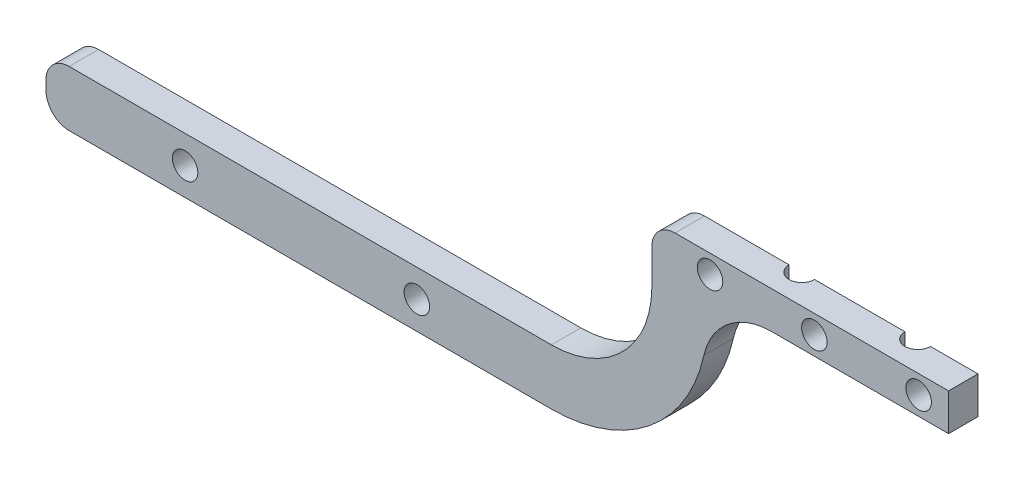
ISO-10303-21;
HEADER;
FILE_DESCRIPTION(('STEP AP214'),'2;1');
FILE_NAME('part.step','',(''),(''),'','','');
FILE_SCHEMA(('AUTOMOTIVE_DESIGN { 1 0 10303 214 1 1 1 1 }'));
ENDSEC;
DATA;
#1=APPLICATION_CONTEXT('core data for automotive mechanical design processes');
#2=APPLICATION_PROTOCOL_DEFINITION('international standard','automotive_design',2000,#1);
#3=PRODUCT_CONTEXT('',#1,'mechanical');
#4=PRODUCT('Part','Part','',(#3));
#5=PRODUCT_RELATED_PRODUCT_CATEGORY('part','',(#4));
#6=PRODUCT_DEFINITION_FORMATION('','',#4);
#7=PRODUCT_DEFINITION_CONTEXT('part definition',#1,'design');
#8=PRODUCT_DEFINITION('design','',#6,#7);
#9=PRODUCT_DEFINITION_SHAPE('','',#8);
#10=(LENGTH_UNIT() NAMED_UNIT(*) SI_UNIT(.MILLI.,.METRE.));
#11=(NAMED_UNIT(*) PLANE_ANGLE_UNIT() SI_UNIT($,.RADIAN.));
#12=(NAMED_UNIT(*) SI_UNIT($,.STERADIAN.) SOLID_ANGLE_UNIT());
#13=UNCERTAINTY_MEASURE_WITH_UNIT(LENGTH_MEASURE(1.E-05),#10,'distance_accuracy_value','');
#14=(GEOMETRIC_REPRESENTATION_CONTEXT(3) GLOBAL_UNCERTAINTY_ASSIGNED_CONTEXT((#13)) GLOBAL_UNIT_ASSIGNED_CONTEXT((#10,
#11,#12)) REPRESENTATION_CONTEXT('',''));
#15=CARTESIAN_POINT('',(0.,0.,0.));
#16=DIRECTION('',(0.,0.,1.));
#17=DIRECTION('',(1.,0.,0.));
#18=AXIS2_PLACEMENT_3D('',#15,#16,#17);
#19=CARTESIAN_POINT('',(-85.6878302558046,-12.5521697441954,0.));
#20=DIRECTION('',(0.,0.,1.));
#21=DIRECTION('',(1.,0.,0.));
#22=AXIS2_PLACEMENT_3D('',#19,#20,#21);
#23=PLANE('',#22);
#24=CARTESIAN_POINT('',(-6.45253062163277,-4.,0.));
#25=DIRECTION('',(0.,0.,1.));
#26=DIRECTION('',(1.,0.,0.));
#27=AXIS2_PLACEMENT_3D('',#24,#25,#26);
#28=CIRCLE('',#27,2.75);
#29=CARTESIAN_POINT('',(-3.70253062163277,-4.,0.));
#30=VERTEX_POINT('',#29);
#31=EDGE_CURVE('E340',#30,#30,#28,.T.);
#32=ORIENTED_EDGE('',*,*,#31,.T.);
#33=EDGE_LOOP('',(#32));
#34=FACE_BOUND('',#33,.T.);
#35=DIRECTION('',(1.,0.,0.));
#36=VECTOR('',#35,1.);
#37=CARTESIAN_POINT('',(0.,-8.,0.));
#38=LINE('',#37,#36);
#39=CARTESIAN_POINT('',(-10.25,-8.,0.));
#40=VERTEX_POINT('',#39);
#41=CARTESIAN_POINT('',(0.,-8.,0.));
#42=VERTEX_POINT('',#41);
#43=EDGE_CURVE('E172',#40,#42,#38,.T.);
#44=ORIENTED_EDGE('',*,*,#43,.F.);
#45=DIRECTION('',(0.,1.,0.));
#46=VECTOR('',#45,1.);
#47=CARTESIAN_POINT('',(-10.25,-46.241,0.));
#48=LINE('',#47,#46);
#49=CARTESIAN_POINT('',(-10.25,0.,0.));
#50=VERTEX_POINT('',#49);
#51=EDGE_CURVE('E160',#50,#40,#48,.F.);
#52=ORIENTED_EDGE('',*,*,#51,.F.);
#53=DIRECTION('',(-1.,0.,0.));
#54=VECTOR('',#53,1.);
#55=CARTESIAN_POINT('',(0.,0.,0.));
#56=LINE('',#55,#54);
#57=CARTESIAN_POINT('',(0.,0.,0.));
#58=VERTEX_POINT('',#57);
#59=EDGE_CURVE('E170',#58,#50,#56,.T.);
#60=ORIENTED_EDGE('',*,*,#59,.F.);
#61=DIRECTION('',(0.,1.,0.));
#62=VECTOR('',#61,1.);
#63=CARTESIAN_POINT('',(0.,0.,0.));
#64=LINE('',#63,#62);
#65=EDGE_CURVE('E185',#42,#58,#64,.T.);
#66=ORIENTED_EDGE('',*,*,#65,.F.);
#67=EDGE_LOOP('',(#44,#52,#60,#66));
#68=FACE_BOUND('',#67,.T.);
#69=ADVANCED_FACE('F39',(#34,#68),#23,.F.);
#70=CARTESIAN_POINT('',(-28.9525306216328,-4.00000000000001,0.));
#71=DIRECTION('',(0.,0.,1.));
#72=DIRECTION('',(1.,0.,0.));
#73=AXIS2_PLACEMENT_3D('',#70,#71,#72);
#74=CIRCLE('',#73,2.75);
#75=CARTESIAN_POINT('',(-26.2025306216328,-4.00000000000001,0.));
#76=VERTEX_POINT('',#75);
#77=EDGE_CURVE('E342',#76,#76,#74,.T.);
#78=ORIENTED_EDGE('',*,*,#77,.T.);
#79=EDGE_LOOP('',(#78));
#80=FACE_BOUND('',#79,.T.);
#81=CARTESIAN_POINT('',(-15.75,0.,0.));
#82=VERTEX_POINT('',#81);
#83=CARTESIAN_POINT('',(-35.25,0.,0.));
#84=VERTEX_POINT('',#83);
#85=EDGE_CURVE('E179',#82,#84,#56,.T.);
#86=ORIENTED_EDGE('',*,*,#85,.F.);
#87=DIRECTION('',(0.,1.,0.));
#88=VECTOR('',#87,1.);
#89=CARTESIAN_POINT('',(-15.75,-46.241,0.));
#90=LINE('',#89,#88);
#91=CARTESIAN_POINT('',(-15.75,-8.,0.));
#92=VERTEX_POINT('',#91);
#93=EDGE_CURVE('E161',#92,#82,#90,.T.);
#94=ORIENTED_EDGE('',*,*,#93,.F.);
#95=CARTESIAN_POINT('',(-35.25,-8.00000000000001,0.));
#96=VERTEX_POINT('',#95);
#97=EDGE_CURVE('E218',#96,#92,#38,.T.);
#98=ORIENTED_EDGE('',*,*,#97,.F.);
#99=DIRECTION('',(0.,1.,0.));
#100=VECTOR('',#99,1.);
#101=CARTESIAN_POINT('',(-35.25,-46.241,0.));
#102=LINE('',#101,#100);
#103=EDGE_CURVE('E237',#84,#96,#102,.F.);
#104=ORIENTED_EDGE('',*,*,#103,.F.);
#105=EDGE_LOOP('',(#86,#94,#98,#104));
#106=FACE_BOUND('',#105,.T.);
#107=ADVANCED_FACE('F285',(#80,#106),#23,.F.);
#108=CARTESIAN_POINT('',(0.,0.,6.35));
#109=DIRECTION('',(-1.,0.,0.));
#110=DIRECTION('',(0.,-1.,0.));
#111=AXIS2_PLACEMENT_3D('',#108,#109,#110);
#112=PLANE('',#111);
#113=ORIENTED_EDGE('',*,*,#65,.T.);
#114=DIRECTION('',(0.,0.,-1.));
#115=VECTOR('',#114,1.);
#116=CARTESIAN_POINT('',(0.,0.,6.35));
#117=LINE('',#116,#115);
#118=CARTESIAN_POINT('',(0.,0.,6.35));
#119=VERTEX_POINT('',#118);
#120=EDGE_CURVE('E176',#119,#58,#117,.T.);
#121=ORIENTED_EDGE('',*,*,#120,.F.);
#122=DIRECTION('',(0.,1.,0.));
#123=VECTOR('',#122,1.);
#124=CARTESIAN_POINT('',(0.,0.,6.35));
#125=LINE('',#124,#123);
#126=CARTESIAN_POINT('',(0.,-8.,6.35));
#127=VERTEX_POINT('',#126);
#128=EDGE_CURVE('E215',#127,#119,#125,.T.);
#129=ORIENTED_EDGE('',*,*,#128,.F.);
#130=DIRECTION('',(0.,0.,-1.));
#131=VECTOR('',#130,1.);
#132=CARTESIAN_POINT('',(0.,-8.,6.35));
#133=LINE('',#132,#131);
#134=EDGE_CURVE('E196',#127,#42,#133,.T.);
#135=ORIENTED_EDGE('',*,*,#134,.T.);
#136=EDGE_LOOP('',(#113,#121,#129,#135));
#137=FACE_BOUND('',#136,.T.);
#138=ADVANCED_FACE('F315',(#137),#112,.F.);
#139=CARTESIAN_POINT('',(0.,0.,6.35));
#140=DIRECTION('',(0.,-1.,0.));
#141=DIRECTION('',(1.,0.,0.));
#142=AXIS2_PLACEMENT_3D('',#139,#140,#141);
#143=PLANE('',#142);
#144=ORIENTED_EDGE('',*,*,#59,.T.);
#145=CARTESIAN_POINT('',(-13.,0.,0.));
#146=DIRECTION('',(0.,1.,0.));
#147=DIRECTION('',(-1.,0.,0.));
#148=AXIS2_PLACEMENT_3D('',#145,#146,#147);
#149=CIRCLE('',#148,2.75);
#150=EDGE_CURVE('E157',#82,#50,#149,.T.);
#151=ORIENTED_EDGE('',*,*,#150,.F.);
#152=ORIENTED_EDGE('',*,*,#85,.T.);
#153=CARTESIAN_POINT('',(-38.,0.,0.));
#154=DIRECTION('',(0.,1.,0.));
#155=DIRECTION('',(-1.,0.,0.));
#156=AXIS2_PLACEMENT_3D('',#153,#154,#155);
#157=CIRCLE('',#156,2.75);
#158=CARTESIAN_POINT('',(-40.75,0.,0.));
#159=VERTEX_POINT('',#158);
#160=EDGE_CURVE('E239',#159,#84,#157,.T.);
#161=ORIENTED_EDGE('',*,*,#160,.F.);
#162=CARTESIAN_POINT('',(-59.,0.,0.));
#163=VERTEX_POINT('',#162);
#164=EDGE_CURVE('E181',#159,#163,#56,.T.);
#165=ORIENTED_EDGE('',*,*,#164,.T.);
#166=DIRECTION('',(0.,0.,-1.));
#167=VECTOR('',#166,1.);
#168=CARTESIAN_POINT('',(-59.,0.,6.35));
#169=LINE('',#168,#167);
#170=CARTESIAN_POINT('',(-59.,0.,6.35));
#171=VERTEX_POINT('',#170);
#172=EDGE_CURVE('E363',#163,#171,#169,.F.);
#173=ORIENTED_EDGE('',*,*,#172,.T.);
#174=DIRECTION('',(-1.,0.,0.));
#175=VECTOR('',#174,1.);
#176=CARTESIAN_POINT('',(0.,0.,6.35));
#177=LINE('',#176,#175);
#178=EDGE_CURVE('E212',#119,#171,#177,.T.);
#179=ORIENTED_EDGE('',*,*,#178,.F.);
#180=ORIENTED_EDGE('',*,*,#120,.T.);
#181=EDGE_LOOP('',(#144,#151,#152,#161,#165,#173,#179,#180));
#182=FACE_BOUND('',#181,.T.);
#183=ADVANCED_FACE('F174',(#182),#143,.F.);
#184=CARTESIAN_POINT('',(-64.,0.,6.35));
#185=DIRECTION('',(1.,0.,0.));
#186=DIRECTION('',(0.,0.,-1.));
#187=AXIS2_PLACEMENT_3D('',#184,#185,#186);
#188=PLANE('',#187);
#189=DIRECTION('',(0.,-1.,0.));
#190=VECTOR('',#189,1.);
#191=CARTESIAN_POINT('',(-64.,0.,6.35));
#192=LINE('',#191,#190);
#193=CARTESIAN_POINT('',(-64.,-5.00000000000001,6.35));
#194=VERTEX_POINT('',#193);
#195=CARTESIAN_POINT('',(-64.,-12.5521697441954,6.35));
#196=VERTEX_POINT('',#195);
#197=EDGE_CURVE('E210',#194,#196,#192,.T.);
#198=ORIENTED_EDGE('',*,*,#197,.F.);
#199=DIRECTION('',(0.,0.,-1.));
#200=VECTOR('',#199,1.);
#201=CARTESIAN_POINT('',(-64.,-5.00000000000001,6.35));
#202=LINE('',#201,#200);
#203=CARTESIAN_POINT('',(-64.,-5.00000000000001,0.));
#204=VERTEX_POINT('',#203);
#205=EDGE_CURVE('E412',#194,#204,#202,.T.);
#206=ORIENTED_EDGE('',*,*,#205,.T.);
#207=DIRECTION('',(0.,-1.,0.));
#208=VECTOR('',#207,1.);
#209=CARTESIAN_POINT('',(-64.,0.,0.));
#210=LINE('',#209,#208);
#211=CARTESIAN_POINT('',(-64.,-12.5521697441954,0.));
#212=VERTEX_POINT('',#211);
#213=EDGE_CURVE('E178',#204,#212,#210,.T.);
#214=ORIENTED_EDGE('',*,*,#213,.T.);
#215=DIRECTION('',(0.,0.,-1.));
#216=VECTOR('',#215,1.);
#217=CARTESIAN_POINT('',(-64.,-12.5521697441954,6.35));
#218=LINE('',#217,#216);
#219=EDGE_CURVE('E414',#196,#212,#218,.T.);
#220=ORIENTED_EDGE('',*,*,#219,.F.);
#221=EDGE_LOOP('',(#198,#206,#214,#220));
#222=FACE_BOUND('',#221,.T.);
#223=ADVANCED_FACE('F308',(#222),#188,.F.);
#224=CARTESIAN_POINT('',(-85.6878302558046,-12.5521697441954,6.35));
#225=DIRECTION('',(0.,0.,-1.));
#226=DIRECTION('',(-1.,0.,0.));
#227=AXIS2_PLACEMENT_3D('',#224,#225,#226);
#228=CYLINDRICAL_SURFACE('',#227,21.6878302558046);
#229=CARTESIAN_POINT('',(-85.6878302558046,-12.5521697441954,0.));
#230=DIRECTION('',(0.,0.,-1.));
#231=DIRECTION('',(-1.,0.,0.));
#232=AXIS2_PLACEMENT_3D('',#229,#230,#231);
#233=CIRCLE('',#232,21.6878302558046);
#234=CARTESIAN_POINT('',(-85.6878302558046,-34.24,0.));
#235=VERTEX_POINT('',#234);
#236=EDGE_CURVE('E182',#212,#235,#233,.T.);
#237=ORIENTED_EDGE('',*,*,#236,.T.);
#238=DIRECTION('',(0.,0.,-1.));
#239=VECTOR('',#238,1.);
#240=CARTESIAN_POINT('',(-85.6878302558046,-34.24,6.35));
#241=LINE('',#240,#239);
#242=CARTESIAN_POINT('',(-85.6878302558046,-34.24,6.35));
#243=VERTEX_POINT('',#242);
#244=EDGE_CURVE('E432',#243,#235,#241,.T.);
#245=ORIENTED_EDGE('',*,*,#244,.F.);
#246=CARTESIAN_POINT('',(-85.6878302558046,-12.5521697441954,6.35));
#247=DIRECTION('',(0.,0.,-1.));
#248=DIRECTION('',(-1.,0.,0.));
#249=AXIS2_PLACEMENT_3D('',#246,#247,#248);
#250=CIRCLE('',#249,21.6878302558046);
#251=EDGE_CURVE('E208',#196,#243,#250,.T.);
#252=ORIENTED_EDGE('',*,*,#251,.F.);
#253=ORIENTED_EDGE('',*,*,#219,.T.);
#254=EDGE_LOOP('',(#237,#245,#252,#253));
#255=FACE_BOUND('',#254,.T.);
#256=ADVANCED_FACE('F304',(#255),#228,.F.);
#257=CARTESIAN_POINT('',(-85.6878302558046,-34.24,6.35));
#258=DIRECTION('',(0.,-1.,0.));
#259=DIRECTION('',(1.,0.,0.));
#260=AXIS2_PLACEMENT_3D('',#257,#258,#259);
#261=PLANE('',#260);
#262=DIRECTION('',(-1.,0.,0.));
#263=VECTOR('',#262,1.);
#264=CARTESIAN_POINT('',(-85.6878302558046,-34.24,0.));
#265=LINE('',#264,#263);
#266=CARTESIAN_POINT('',(-189.687830255805,-34.24,0.));
#267=VERTEX_POINT('',#266);
#268=EDGE_CURVE('E428',#235,#267,#265,.T.);
#269=ORIENTED_EDGE('',*,*,#268,.T.);
#270=DIRECTION('',(0.,0.,-1.));
#271=VECTOR('',#270,1.);
#272=CARTESIAN_POINT('',(-189.687830255805,-34.24,6.35));
#273=LINE('',#272,#271);
#274=CARTESIAN_POINT('',(-189.687830255805,-34.24,6.35));
#275=VERTEX_POINT('',#274);
#276=EDGE_CURVE('E384',#267,#275,#273,.F.);
#277=ORIENTED_EDGE('',*,*,#276,.T.);
#278=DIRECTION('',(-1.,0.,0.));
#279=VECTOR('',#278,1.);
#280=CARTESIAN_POINT('',(-85.6878302558046,-34.24,6.35));
#281=LINE('',#280,#279);
#282=EDGE_CURVE('E205',#243,#275,#281,.T.);
#283=ORIENTED_EDGE('',*,*,#282,.F.);
#284=ORIENTED_EDGE('',*,*,#244,.T.);
#285=EDGE_LOOP('',(#269,#277,#283,#284));
#286=FACE_BOUND('',#285,.T.);
#287=ADVANCED_FACE('F300',(#286),#261,.F.);
#288=CARTESIAN_POINT('',(-194.687830255805,-34.24,6.35));
#289=DIRECTION('',(1.,0.,0.));
#290=DIRECTION('',(0.,0.,-1.));
#291=AXIS2_PLACEMENT_3D('',#288,#289,#290);
#292=PLANE('',#291);
#293=DIRECTION('',(0.,-1.,0.));
#294=VECTOR('',#293,1.);
#295=CARTESIAN_POINT('',(-194.687830255805,-34.24,0.));
#296=LINE('',#295,#294);
#297=CARTESIAN_POINT('',(-194.687830255805,-39.24,0.));
#298=VERTEX_POINT('',#297);
#299=CARTESIAN_POINT('',(-194.687830255805,-41.24,0.));
#300=VERTEX_POINT('',#299);
#301=EDGE_CURVE('E423',#298,#300,#296,.T.);
#302=ORIENTED_EDGE('',*,*,#301,.T.);
#303=DIRECTION('',(0.,0.,-1.));
#304=VECTOR('',#303,1.);
#305=CARTESIAN_POINT('',(-194.687830255805,-41.24,6.35));
#306=LINE('',#305,#304);
#307=CARTESIAN_POINT('',(-194.687830255805,-41.24,6.35));
#308=VERTEX_POINT('',#307);
#309=EDGE_CURVE('E382',#300,#308,#306,.F.);
#310=ORIENTED_EDGE('',*,*,#309,.T.);
#311=DIRECTION('',(0.,-1.,0.));
#312=VECTOR('',#311,1.);
#313=CARTESIAN_POINT('',(-194.687830255805,-34.24,6.35));
#314=LINE('',#313,#312);
#315=CARTESIAN_POINT('',(-194.687830255805,-39.24,6.35));
#316=VERTEX_POINT('',#315);
#317=EDGE_CURVE('E202',#316,#308,#314,.T.);
#318=ORIENTED_EDGE('',*,*,#317,.F.);
#319=DIRECTION('',(0.,0.,-1.));
#320=VECTOR('',#319,1.);
#321=CARTESIAN_POINT('',(-194.687830255805,-39.24,6.35));
#322=LINE('',#321,#320);
#323=EDGE_CURVE('E379',#316,#298,#322,.T.);
#324=ORIENTED_EDGE('',*,*,#323,.T.);
#325=EDGE_LOOP('',(#302,#310,#318,#324));
#326=FACE_BOUND('',#325,.T.);
#327=ADVANCED_FACE('F296',(#326),#292,.F.);
#328=CARTESIAN_POINT('',(-194.687830255805,-46.24,6.35));
#329=DIRECTION('',(0.,1.,0.));
#330=DIRECTION('',(-1.,0.,0.));
#331=AXIS2_PLACEMENT_3D('',#328,#329,#330);
#332=PLANE('',#331);
#333=DIRECTION('',(1.,0.,0.));
#334=VECTOR('',#333,1.);
#335=CARTESIAN_POINT('',(-194.687830255805,-46.24,6.35));
#336=LINE('',#335,#334);
#337=CARTESIAN_POINT('',(-189.687830255805,-46.24,6.35));
#338=VERTEX_POINT('',#337);
#339=CARTESIAN_POINT('',(-85.6878302558046,-46.24,6.35));
#340=VERTEX_POINT('',#339);
#341=EDGE_CURVE('E200',#338,#340,#336,.T.);
#342=ORIENTED_EDGE('',*,*,#341,.F.);
#343=DIRECTION('',(0.,0.,-1.));
#344=VECTOR('',#343,1.);
#345=CARTESIAN_POINT('',(-189.687830255805,-46.24,6.35));
#346=LINE('',#345,#344);
#347=CARTESIAN_POINT('',(-189.687830255805,-46.24,0.));
#348=VERTEX_POINT('',#347);
#349=EDGE_CURVE('E376',#338,#348,#346,.T.);
#350=ORIENTED_EDGE('',*,*,#349,.T.);
#351=DIRECTION('',(1.,0.,0.));
#352=VECTOR('',#351,1.);
#353=CARTESIAN_POINT('',(-194.687830255805,-46.24,0.));
#354=LINE('',#353,#352);
#355=CARTESIAN_POINT('',(-85.6878302558046,-46.24,0.));
#356=VERTEX_POINT('',#355);
#357=EDGE_CURVE('E400',#348,#356,#354,.T.);
#358=ORIENTED_EDGE('',*,*,#357,.T.);
#359=DIRECTION('',(0.,0.,-1.));
#360=VECTOR('',#359,1.);
#361=CARTESIAN_POINT('',(-85.6878302558046,-46.24,6.35));
#362=LINE('',#361,#360);
#363=EDGE_CURVE('E399',#340,#356,#362,.T.);
#364=ORIENTED_EDGE('',*,*,#363,.F.);
#365=EDGE_LOOP('',(#342,#350,#358,#364));
#366=FACE_BOUND('',#365,.T.);
#367=ADVANCED_FACE('F292',(#366),#332,.F.);
#368=CARTESIAN_POINT('',(-85.6878302558046,-12.5521697441954,6.35));
#369=DIRECTION('',(0.,0.,-1.));
#370=DIRECTION('',(-1.,0.,0.));
#371=AXIS2_PLACEMENT_3D('',#368,#369,#370);
#372=CYLINDRICAL_SURFACE('',#371,33.6878302558046);
#373=CARTESIAN_POINT('',(-85.6878302558046,-12.5521697441954,0.));
#374=DIRECTION('',(0.,0.,1.));
#375=DIRECTION('',(1.,0.,0.));
#376=AXIS2_PLACEMENT_3D('',#373,#374,#375);
#377=CIRCLE('',#376,33.6878302558046);
#378=CARTESIAN_POINT('',(-52.7847704375923,-19.7811781093206,0.));
#379=VERTEX_POINT('',#378);
#380=EDGE_CURVE('E394',#356,#379,#377,.T.);
#381=ORIENTED_EDGE('',*,*,#380,.T.);
#382=DIRECTION('',(0.,0.,-1.));
#383=VECTOR('',#382,1.);
#384=CARTESIAN_POINT('',(-52.7847704375923,-19.7811781093206,6.35));
#385=LINE('',#384,#383);
#386=CARTESIAN_POINT('',(-52.7847704375923,-19.7811781093206,6.35));
#387=VERTEX_POINT('',#386);
#388=EDGE_CURVE('E389',#379,#387,#385,.F.);
#389=ORIENTED_EDGE('',*,*,#388,.T.);
#390=CARTESIAN_POINT('',(-85.6878302558046,-12.5521697441954,6.35));
#391=DIRECTION('',(0.,0.,1.));
#392=DIRECTION('',(1.,0.,0.));
#393=AXIS2_PLACEMENT_3D('',#390,#391,#392);
#394=CIRCLE('',#393,33.6878302558046);
#395=EDGE_CURVE('E197',#340,#387,#394,.T.);
#396=ORIENTED_EDGE('',*,*,#395,.F.);
#397=ORIENTED_EDGE('',*,*,#363,.T.);
#398=EDGE_LOOP('',(#381,#389,#396,#397));
#399=FACE_BOUND('',#398,.T.);
#400=ADVANCED_FACE('F288',(#399),#372,.T.);
#401=CARTESIAN_POINT('',(0.,-8.,6.35));
#402=DIRECTION('',(0.,1.,0.));
#403=DIRECTION('',(-1.,0.,0.));
#404=AXIS2_PLACEMENT_3D('',#401,#402,#403);
#405=PLANE('',#404);
#406=ORIENTED_EDGE('',*,*,#97,.T.);
#407=CARTESIAN_POINT('',(-13.,-8.,0.));
#408=DIRECTION('',(0.,1.,0.));
#409=DIRECTION('',(-1.,0.,0.));
#410=AXIS2_PLACEMENT_3D('',#407,#408,#409);
#411=CIRCLE('',#410,2.75);
#412=EDGE_CURVE('E56',#40,#92,#411,.F.);
#413=ORIENTED_EDGE('',*,*,#412,.F.);
#414=ORIENTED_EDGE('',*,*,#43,.T.);
#415=ORIENTED_EDGE('',*,*,#134,.F.);
#416=DIRECTION('',(1.,0.,0.));
#417=VECTOR('',#416,1.);
#418=CARTESIAN_POINT('',(0.,-8.,6.35));
#419=LINE('',#418,#417);
#420=CARTESIAN_POINT('',(-38.134200973026,-8.00000000000001,6.35));
#421=VERTEX_POINT('',#420);
#422=EDGE_CURVE('E194',#421,#127,#419,.T.);
#423=ORIENTED_EDGE('',*,*,#422,.F.);
#424=DIRECTION('',(0.,0.,1.));
#425=VECTOR('',#424,1.);
#426=CARTESIAN_POINT('',(-38.134200973026,-8.00000000000001,0.));
#427=LINE('',#426,#425);
#428=CARTESIAN_POINT('',(-38.134200973026,-8.00000000000001,2.74672352064034));
#429=VERTEX_POINT('',#428);
#430=EDGE_CURVE('E386',#421,#429,#427,.F.);
#431=ORIENTED_EDGE('',*,*,#430,.T.);
#432=CARTESIAN_POINT('',(-38.,-8.00000000000001,0.));
#433=DIRECTION('',(0.,1.,0.));
#434=DIRECTION('',(-1.,0.,0.));
#435=AXIS2_PLACEMENT_3D('',#432,#433,#434);
#436=CIRCLE('',#435,2.75);
#437=EDGE_CURVE('E64',#96,#429,#436,.F.);
#438=ORIENTED_EDGE('',*,*,#437,.F.);
#439=EDGE_LOOP('',(#406,#413,#414,#415,#423,#431,#438));
#440=FACE_BOUND('',#439,.T.);
#441=ADVANCED_FACE('F279',(#440),#405,.F.);
#442=CARTESIAN_POINT('',(-85.6878302558046,-12.5521697441954,6.35));
#443=DIRECTION('',(0.,0.,1.));
#444=DIRECTION('',(1.,0.,0.));
#445=AXIS2_PLACEMENT_3D('',#442,#443,#444);
#446=PLANE('',#445);
#447=CARTESIAN_POINT('',(-164.687830255805,-40.24,6.35));
#448=DIRECTION('',(0.,0.,1.));
#449=DIRECTION('',(1.,0.,0.));
#450=AXIS2_PLACEMENT_3D('',#447,#448,#449);
#451=CIRCLE('',#450,2.75000000000001);
#452=CARTESIAN_POINT('',(-161.937830255805,-40.24,6.35));
#453=VERTEX_POINT('',#452);
#454=EDGE_CURVE('E226',#453,#453,#451,.T.);
#455=ORIENTED_EDGE('',*,*,#454,.F.);
#456=EDGE_LOOP('',(#455));
#457=FACE_BOUND('',#456,.T.);
#458=CARTESIAN_POINT('',(-51.4525306216328,-4.00000000000001,6.35));
#459=DIRECTION('',(0.,0.,1.));
#460=DIRECTION('',(1.,0.,0.));
#461=AXIS2_PLACEMENT_3D('',#458,#459,#460);
#462=CIRCLE('',#461,2.75);
#463=CARTESIAN_POINT('',(-48.7025306216328,-4.00000000000001,6.35));
#464=VERTEX_POINT('',#463);
#465=EDGE_CURVE('E227',#464,#464,#462,.T.);
#466=ORIENTED_EDGE('',*,*,#465,.F.);
#467=EDGE_LOOP('',(#466));
#468=FACE_BOUND('',#467,.T.);
#469=CARTESIAN_POINT('',(-28.9525306216328,-4.00000000000001,6.35));
#470=DIRECTION('',(0.,0.,1.));
#471=DIRECTION('',(1.,0.,0.));
#472=AXIS2_PLACEMENT_3D('',#469,#470,#471);
#473=CIRCLE('',#472,2.75);
#474=CARTESIAN_POINT('',(-26.2025306216328,-4.00000000000001,6.35));
#475=VERTEX_POINT('',#474);
#476=EDGE_CURVE('E223',#475,#475,#473,.T.);
#477=ORIENTED_EDGE('',*,*,#476,.F.);
#478=EDGE_LOOP('',(#477));
#479=FACE_BOUND('',#478,.T.);
#480=CARTESIAN_POINT('',(-6.45253062163277,-4.,6.35));
#481=DIRECTION('',(0.,0.,1.));
#482=DIRECTION('',(1.,0.,0.));
#483=AXIS2_PLACEMENT_3D('',#480,#481,#482);
#484=CIRCLE('',#483,2.75);
#485=CARTESIAN_POINT('',(-3.70253062163277,-4.,6.35));
#486=VERTEX_POINT('',#485);
#487=EDGE_CURVE('E219',#486,#486,#484,.T.);
#488=ORIENTED_EDGE('',*,*,#487,.F.);
#489=EDGE_LOOP('',(#488));
#490=FACE_BOUND('',#489,.T.);
#491=CARTESIAN_POINT('',(-114.687830255805,-40.24,6.35));
#492=DIRECTION('',(0.,0.,1.));
#493=DIRECTION('',(1.,0.,0.));
#494=AXIS2_PLACEMENT_3D('',#491,#492,#493);
#495=CIRCLE('',#494,2.75000000000001);
#496=CARTESIAN_POINT('',(-111.937830255805,-40.24,6.35));
#497=VERTEX_POINT('',#496);
#498=EDGE_CURVE('E222',#497,#497,#495,.T.);
#499=ORIENTED_EDGE('',*,*,#498,.F.);
#500=EDGE_LOOP('',(#499));
#501=FACE_BOUND('',#500,.T.);
#502=ORIENTED_EDGE('',*,*,#178,.T.);
#503=CARTESIAN_POINT('',(-59.,-5.00000000000001,6.35));
#504=DIRECTION('',(0.,0.,1.));
#505=DIRECTION('',(1.,0.,0.));
#506=AXIS2_PLACEMENT_3D('',#503,#504,#505);
#507=CIRCLE('',#506,5.);
#508=EDGE_CURVE('E367',#171,#194,#507,.T.);
#509=ORIENTED_EDGE('',*,*,#508,.T.);
#510=ORIENTED_EDGE('',*,*,#197,.T.);
#511=ORIENTED_EDGE('',*,*,#251,.T.);
#512=ORIENTED_EDGE('',*,*,#282,.T.);
#513=CARTESIAN_POINT('',(-189.687830255805,-39.24,6.35));
#514=DIRECTION('',(0.,0.,1.));
#515=DIRECTION('',(1.,0.,0.));
#516=AXIS2_PLACEMENT_3D('',#513,#514,#515);
#517=CIRCLE('',#516,5.);
#518=EDGE_CURVE('E368',#275,#316,#517,.T.);
#519=ORIENTED_EDGE('',*,*,#518,.T.);
#520=ORIENTED_EDGE('',*,*,#317,.T.);
#521=CARTESIAN_POINT('',(-189.687830255805,-41.24,6.35));
#522=DIRECTION('',(0.,0.,1.));
#523=DIRECTION('',(1.,0.,0.));
#524=AXIS2_PLACEMENT_3D('',#521,#522,#523);
#525=CIRCLE('',#524,5.);
#526=EDGE_CURVE('E370',#308,#338,#525,.T.);
#527=ORIENTED_EDGE('',*,*,#526,.T.);
#528=ORIENTED_EDGE('',*,*,#341,.T.);
#529=ORIENTED_EDGE('',*,*,#395,.T.);
#530=CARTESIAN_POINT('',(-38.134200973026,-23.,6.35));
#531=DIRECTION('',(0.,0.,1.));
#532=DIRECTION('',(1.,0.,0.));
#533=AXIS2_PLACEMENT_3D('',#530,#531,#532);
#534=CIRCLE('',#533,15.);
#535=EDGE_CURVE('E11',#387,#421,#534,.F.);
#536=ORIENTED_EDGE('',*,*,#535,.T.);
#537=ORIENTED_EDGE('',*,*,#422,.T.);
#538=ORIENTED_EDGE('',*,*,#128,.T.);
#539=EDGE_LOOP('',(#502,#509,#510,#511,#512,#519,#520,#527,#528,#529,#536,#537,#538));
#540=FACE_BOUND('',#539,.T.);
#541=ADVANCED_FACE('F275',(#457,#468,#479,#490,#501,#540),#446,.T.);
#542=CARTESIAN_POINT('',(-164.687830255805,-40.24,0.));
#543=DIRECTION('',(0.,0.,1.));
#544=DIRECTION('',(1.,0.,0.));
#545=AXIS2_PLACEMENT_3D('',#542,#543,#544);
#546=CIRCLE('',#545,2.75000000000001);
#547=CARTESIAN_POINT('',(-161.937830255805,-40.24,0.));
#548=VERTEX_POINT('',#547);
#549=EDGE_CURVE('E43',#548,#548,#546,.T.);
#550=ORIENTED_EDGE('',*,*,#549,.T.);
#551=EDGE_LOOP('',(#550));
#552=FACE_BOUND('',#551,.T.);
#553=CARTESIAN_POINT('',(-51.4525306216328,-4.00000000000001,0.));
#554=DIRECTION('',(0.,0.,1.));
#555=DIRECTION('',(1.,0.,0.));
#556=AXIS2_PLACEMENT_3D('',#553,#554,#555);
#557=CIRCLE('',#556,2.75);
#558=CARTESIAN_POINT('',(-48.7025306216328,-4.00000000000001,0.));
#559=VERTEX_POINT('',#558);
#560=EDGE_CURVE('E192',#559,#559,#557,.T.);
#561=ORIENTED_EDGE('',*,*,#560,.T.);
#562=EDGE_LOOP('',(#561));
#563=FACE_BOUND('',#562,.T.);
#564=CARTESIAN_POINT('',(-114.687830255805,-40.24,0.));
#565=DIRECTION('',(0.,0.,1.));
#566=DIRECTION('',(1.,0.,0.));
#567=AXIS2_PLACEMENT_3D('',#564,#565,#566);
#568=CIRCLE('',#567,2.75000000000001);
#569=CARTESIAN_POINT('',(-111.937830255805,-40.24,0.));
#570=VERTEX_POINT('',#569);
#571=EDGE_CURVE('E234',#570,#570,#568,.T.);
#572=ORIENTED_EDGE('',*,*,#571,.T.);
#573=EDGE_LOOP('',(#572));
#574=FACE_BOUND('',#573,.T.);
#575=ORIENTED_EDGE('',*,*,#164,.F.);
#576=DIRECTION('',(0.,1.,0.));
#577=VECTOR('',#576,1.);
#578=CARTESIAN_POINT('',(-40.75,-46.241,0.));
#579=LINE('',#578,#577);
#580=CARTESIAN_POINT('',(-40.75,-8.22984104857088,0.));
#581=VERTEX_POINT('',#580);
#582=EDGE_CURVE('E235',#581,#159,#579,.T.);
#583=ORIENTED_EDGE('',*,*,#582,.F.);
#584=CARTESIAN_POINT('',(-38.134200973026,-23.,0.));
#585=DIRECTION('',(0.,0.,1.));
#586=DIRECTION('',(1.,0.,0.));
#587=AXIS2_PLACEMENT_3D('',#584,#585,#586);
#588=CIRCLE('',#587,15.);
#589=EDGE_CURVE('E48',#581,#379,#588,.T.);
#590=ORIENTED_EDGE('',*,*,#589,.T.);
#591=ORIENTED_EDGE('',*,*,#380,.F.);
#592=ORIENTED_EDGE('',*,*,#357,.F.);
#593=CARTESIAN_POINT('',(-189.687830255805,-41.24,0.));
#594=DIRECTION('',(0.,0.,1.));
#595=DIRECTION('',(1.,0.,0.));
#596=AXIS2_PLACEMENT_3D('',#593,#594,#595);
#597=CIRCLE('',#596,5.);
#598=EDGE_CURVE('E364',#348,#300,#597,.F.);
#599=ORIENTED_EDGE('',*,*,#598,.T.);
#600=ORIENTED_EDGE('',*,*,#301,.F.);
#601=CARTESIAN_POINT('',(-189.687830255805,-39.24,0.));
#602=DIRECTION('',(0.,0.,1.));
#603=DIRECTION('',(1.,0.,0.));
#604=AXIS2_PLACEMENT_3D('',#601,#602,#603);
#605=CIRCLE('',#604,5.);
#606=EDGE_CURVE('E416',#298,#267,#605,.F.);
#607=ORIENTED_EDGE('',*,*,#606,.T.);
#608=ORIENTED_EDGE('',*,*,#268,.F.);
#609=ORIENTED_EDGE('',*,*,#236,.F.);
#610=ORIENTED_EDGE('',*,*,#213,.F.);
#611=CARTESIAN_POINT('',(-59.,-5.00000000000001,0.));
#612=DIRECTION('',(0.,0.,1.));
#613=DIRECTION('',(1.,0.,0.));
#614=AXIS2_PLACEMENT_3D('',#611,#612,#613);
#615=CIRCLE('',#614,5.);
#616=EDGE_CURVE('E358',#204,#163,#615,.F.);
#617=ORIENTED_EDGE('',*,*,#616,.T.);
#618=EDGE_LOOP('',(#575,#583,#590,#591,#592,#599,#600,#607,#608,#609,#610,#617));
#619=FACE_BOUND('',#618,.T.);
#620=ADVANCED_FACE('F278',(#552,#563,#574,#619),#23,.F.);
#621=CARTESIAN_POINT('',(-59.,-5.00000000000001,6.35));
#622=DIRECTION('',(0.,0.,-1.));
#623=DIRECTION('',(-1.,0.,0.));
#624=AXIS2_PLACEMENT_3D('',#621,#622,#623);
#625=CYLINDRICAL_SURFACE('',#624,5.);
#626=ORIENTED_EDGE('',*,*,#508,.F.);
#627=ORIENTED_EDGE('',*,*,#172,.F.);
#628=ORIENTED_EDGE('',*,*,#616,.F.);
#629=ORIENTED_EDGE('',*,*,#205,.F.);
#630=EDGE_LOOP('',(#626,#627,#628,#629));
#631=FACE_BOUND('',#630,.T.);
#632=ADVANCED_FACE('F283',(#631),#625,.T.);
#633=CARTESIAN_POINT('',(-189.687830255805,-41.24,6.35));
#634=DIRECTION('',(0.,0.,-1.));
#635=DIRECTION('',(-1.,0.,0.));
#636=AXIS2_PLACEMENT_3D('',#633,#634,#635);
#637=CYLINDRICAL_SURFACE('',#636,5.);
#638=ORIENTED_EDGE('',*,*,#526,.F.);
#639=ORIENTED_EDGE('',*,*,#309,.F.);
#640=ORIENTED_EDGE('',*,*,#598,.F.);
#641=ORIENTED_EDGE('',*,*,#349,.F.);
#642=EDGE_LOOP('',(#638,#639,#640,#641));
#643=FACE_BOUND('',#642,.T.);
#644=ADVANCED_FACE('F320',(#643),#637,.T.);
#645=CARTESIAN_POINT('',(-189.687830255805,-39.24,6.35));
#646=DIRECTION('',(0.,0.,-1.));
#647=DIRECTION('',(-1.,0.,0.));
#648=AXIS2_PLACEMENT_3D('',#645,#646,#647);
#649=CYLINDRICAL_SURFACE('',#648,5.);
#650=ORIENTED_EDGE('',*,*,#518,.F.);
#651=ORIENTED_EDGE('',*,*,#276,.F.);
#652=ORIENTED_EDGE('',*,*,#606,.F.);
#653=ORIENTED_EDGE('',*,*,#323,.F.);
#654=EDGE_LOOP('',(#650,#651,#652,#653));
#655=FACE_BOUND('',#654,.T.);
#656=ADVANCED_FACE('F323',(#655),#649,.T.);
#657=CARTESIAN_POINT('',(-38.134200973026,-23.,6.35));
#658=DIRECTION('',(0.,0.,-1.));
#659=DIRECTION('',(-1.,0.,0.));
#660=AXIS2_PLACEMENT_3D('',#657,#658,#659);
#661=CYLINDRICAL_SURFACE('',#660,15.);
#662=ORIENTED_EDGE('',*,*,#589,.F.);
#663=CARTESIAN_POINT('',(-38.134200973026,-8.00000000000001,2.74672352064034));
#664=CARTESIAN_POINT('',(-38.2108335559254,-7.99999444331259,2.74298748938228));
#665=CARTESIAN_POINT('',(-38.2873040931662,-8.00058713922194,2.73602854997542));
#666=CARTESIAN_POINT('',(-38.4393720275473,-8.0029133184828,2.71575481129172));
#667=CARTESIAN_POINT('',(-38.5149695215431,-8.00464667402802,2.70244072412929));
#668=CARTESIAN_POINT('',(-38.6646566243315,-8.00919534524404,2.6695684127049));
#669=CARTESIAN_POINT('',(-38.7387481657535,-8.01200916809179,2.65001880999992));
#670=CARTESIAN_POINT('',(-38.8849851223723,-8.0186218536759,2.60483515648356));
#671=CARTESIAN_POINT('',(-38.9571305335688,-8.0224207184368,2.57920109316684));
#672=CARTESIAN_POINT('',(-39.1699152613968,-8.03512779475429,2.49341828228826));
#673=CARTESIAN_POINT('',(-39.3070095747824,-8.04534998194946,2.42436539265486));
#674=CARTESIAN_POINT('',(-39.5676241592745,-8.06807182862282,2.26460900459081));
#675=CARTESIAN_POINT('',(-39.691143900354,-8.0805715769791,2.173904661205));
#676=CARTESIAN_POINT('',(-39.9225514196479,-8.10652830087425,1.97232352030094));
#677=CARTESIAN_POINT('',(-40.0302723745869,-8.11999352631784,1.86125594539744));
#678=CARTESIAN_POINT('',(-40.2256610016869,-8.1461941865441,1.62256826071098));
#679=CARTESIAN_POINT('',(-40.3133230940184,-8.15892941752557,1.49494356061955));
#680=CARTESIAN_POINT('',(-40.4665507525349,-8.1822334213953,1.22586642054482));
#681=CARTESIAN_POINT('',(-40.531981925693,-8.19278887150694,1.084336322036));
#682=CARTESIAN_POINT('',(-40.6380154630544,-8.21034707088235,0.792130331173696));
#683=CARTESIAN_POINT('',(-40.6786435089966,-8.21735349360745,0.641464076974112));
#684=CARTESIAN_POINT('',(-40.7208169017524,-8.22469575939914,0.407909646227999));
#685=CARTESIAN_POINT('',(-40.7317586108755,-8.2266192412328,0.326661441658059));
#686=CARTESIAN_POINT('',(-40.7463452933083,-8.22919341842279,0.163621785509527));
#687=CARTESIAN_POINT('',(-40.7500017265516,-8.22984611272485,0.0818313905099495));
#688=CARTESIAN_POINT('',(-40.75,-8.22984104857088,0.));
#689=B_SPLINE_CURVE_WITH_KNOTS('',3,(#663,#664,#665,#666,#667,#668,#669,#670,#671,#672,#673,
#674,#675,#676,#677,#678,#679,#680,#681,#682,#683,#684,#685,#686,#687,#688),.UNSPECIFIED.,.F.,
.F.,(4,2,2,2,2,2,2,2,2,2,2,2,4),(0.,0.230093045131893,0.460160313660527,0.689910847877426,
0.919661854302873,1.3788406102955,1.8380372888221,2.30177901549816,2.76564958609599,
3.23227648266377,3.69841939971023,3.94413539668606,4.1894645697224),.UNSPECIFIED.);
#690=EDGE_CURVE('E241',#429,#581,#689,.T.);
#691=ORIENTED_EDGE('',*,*,#690,.F.);
#692=ORIENTED_EDGE('',*,*,#430,.F.);
#693=ORIENTED_EDGE('',*,*,#535,.F.);
#694=ORIENTED_EDGE('',*,*,#388,.F.);
#695=EDGE_LOOP('',(#662,#691,#692,#693,#694));
#696=FACE_BOUND('',#695,.T.);
#697=ADVANCED_FACE('F41',(#696),#661,.F.);
#698=CARTESIAN_POINT('',(-114.687830255805,-40.24,-3.65));
#699=DIRECTION('',(0.,0.,1.));
#700=DIRECTION('',(1.,0.,0.));
#701=AXIS2_PLACEMENT_3D('',#698,#699,#700);
#702=CYLINDRICAL_SURFACE('',#701,2.75000000000001);
#703=ORIENTED_EDGE('',*,*,#498,.T.);
#704=EDGE_LOOP('',(#703));
#705=FACE_BOUND('',#704,.T.);
#706=ORIENTED_EDGE('',*,*,#571,.F.);
#707=EDGE_LOOP('',(#706));
#708=FACE_BOUND('',#707,.T.);
#709=ADVANCED_FACE('F268',(#705,#708),#702,.F.);
#710=CARTESIAN_POINT('',(-6.45253062163277,-4.,-3.65));
#711=DIRECTION('',(0.,0.,1.));
#712=DIRECTION('',(1.,0.,0.));
#713=AXIS2_PLACEMENT_3D('',#710,#711,#712);
#714=CYLINDRICAL_SURFACE('',#713,2.75);
#715=ORIENTED_EDGE('',*,*,#487,.T.);
#716=EDGE_LOOP('',(#715));
#717=FACE_BOUND('',#716,.T.);
#718=ORIENTED_EDGE('',*,*,#31,.F.);
#719=EDGE_LOOP('',(#718));
#720=FACE_BOUND('',#719,.T.);
#721=ADVANCED_FACE('F263',(#717,#720),#714,.F.);
#722=CARTESIAN_POINT('',(-28.9525306216328,-4.00000000000001,-3.65));
#723=DIRECTION('',(0.,0.,1.));
#724=DIRECTION('',(1.,0.,0.));
#725=AXIS2_PLACEMENT_3D('',#722,#723,#724);
#726=CYLINDRICAL_SURFACE('',#725,2.75);
#727=ORIENTED_EDGE('',*,*,#476,.T.);
#728=EDGE_LOOP('',(#727));
#729=FACE_BOUND('',#728,.T.);
#730=ORIENTED_EDGE('',*,*,#77,.F.);
#731=EDGE_LOOP('',(#730));
#732=FACE_BOUND('',#731,.T.);
#733=ADVANCED_FACE('F260',(#729,#732),#726,.F.);
#734=CARTESIAN_POINT('',(-51.4525306216328,-4.00000000000001,-3.65));
#735=DIRECTION('',(0.,0.,1.));
#736=DIRECTION('',(1.,0.,0.));
#737=AXIS2_PLACEMENT_3D('',#734,#735,#736);
#738=CYLINDRICAL_SURFACE('',#737,2.75);
#739=ORIENTED_EDGE('',*,*,#465,.T.);
#740=EDGE_LOOP('',(#739));
#741=FACE_BOUND('',#740,.T.);
#742=ORIENTED_EDGE('',*,*,#560,.F.);
#743=EDGE_LOOP('',(#742));
#744=FACE_BOUND('',#743,.T.);
#745=ADVANCED_FACE('F258',(#741,#744),#738,.F.);
#746=CARTESIAN_POINT('',(-164.687830255805,-40.24,-3.65));
#747=DIRECTION('',(0.,0.,1.));
#748=DIRECTION('',(1.,0.,0.));
#749=AXIS2_PLACEMENT_3D('',#746,#747,#748);
#750=CYLINDRICAL_SURFACE('',#749,2.75000000000001);
#751=ORIENTED_EDGE('',*,*,#454,.T.);
#752=EDGE_LOOP('',(#751));
#753=FACE_BOUND('',#752,.T.);
#754=ORIENTED_EDGE('',*,*,#549,.F.);
#755=EDGE_LOOP('',(#754));
#756=FACE_BOUND('',#755,.T.);
#757=ADVANCED_FACE('F255',(#753,#756),#750,.F.);
#758=CARTESIAN_POINT('',(-38.,-46.241,0.));
#759=DIRECTION('',(0.,1.,0.));
#760=DIRECTION('',(-1.,0.,0.));
#761=AXIS2_PLACEMENT_3D('',#758,#759,#760);
#762=CYLINDRICAL_SURFACE('',#761,2.75);
#763=ORIENTED_EDGE('',*,*,#103,.T.);
#764=ORIENTED_EDGE('',*,*,#437,.T.);
#765=ORIENTED_EDGE('',*,*,#690,.T.);
#766=ORIENTED_EDGE('',*,*,#582,.T.);
#767=ORIENTED_EDGE('',*,*,#160,.T.);
#768=EDGE_LOOP('',(#763,#764,#765,#766,#767));
#769=FACE_BOUND('',#768,.T.);
#770=ADVANCED_FACE('F250',(#769),#762,.F.);
#771=CARTESIAN_POINT('',(-13.,-46.241,0.));
#772=DIRECTION('',(0.,1.,0.));
#773=DIRECTION('',(-1.,0.,0.));
#774=AXIS2_PLACEMENT_3D('',#771,#772,#773);
#775=CYLINDRICAL_SURFACE('',#774,2.75);
#776=ORIENTED_EDGE('',*,*,#51,.T.);
#777=ORIENTED_EDGE('',*,*,#412,.T.);
#778=ORIENTED_EDGE('',*,*,#93,.T.);
#779=ORIENTED_EDGE('',*,*,#150,.T.);
#780=EDGE_LOOP('',(#776,#777,#778,#779));
#781=FACE_BOUND('',#780,.T.);
#782=ADVANCED_FACE('F159',(#781),#775,.F.);
#783=CLOSED_SHELL('',(#69,#107,#138,#183,#223,#256,#287,#327,#367,#400,#441,#541,#620,#632,#644,
#656,#697,#709,#721,#733,#745,#757,#770,#782));
#784=MANIFOLD_SOLID_BREP('B2',#783);
#785=ADVANCED_BREP_SHAPE_REPRESENTATION('',(#18,#784),#14);
#786=SHAPE_DEFINITION_REPRESENTATION(#9,#785);
ENDSEC;
END-ISO-10303-21;
